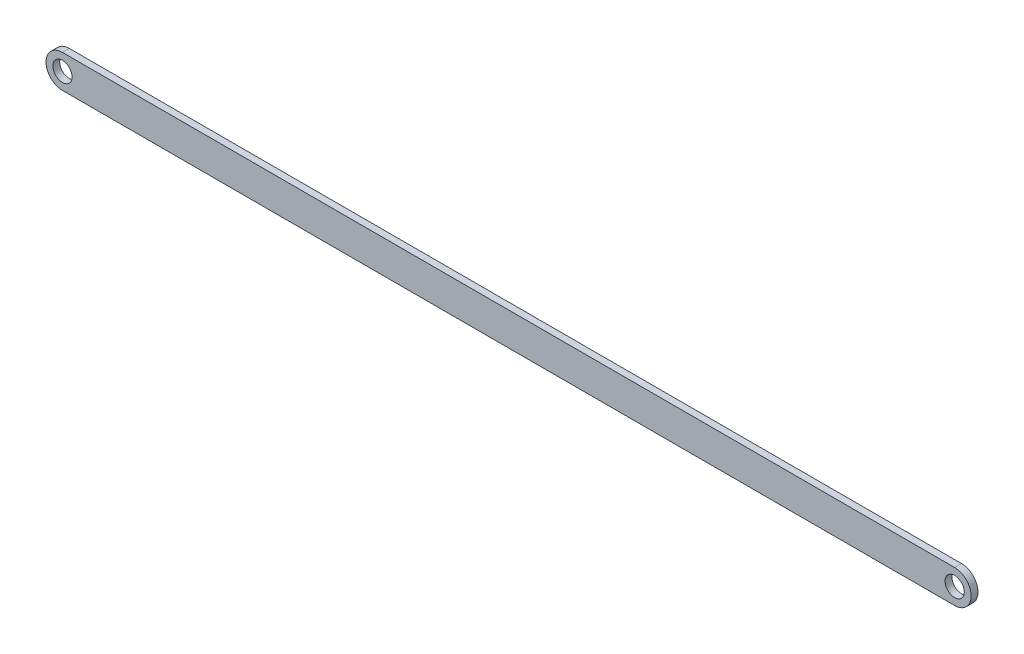
ISO-10303-21;
HEADER;
FILE_DESCRIPTION(('STEP AP214'),'2;1');
FILE_NAME('part.step','',(''),(''),'','','');
FILE_SCHEMA(('AUTOMOTIVE_DESIGN { 1 0 10303 214 1 1 1 1 }'));
ENDSEC;
DATA;
#1=APPLICATION_CONTEXT('core data for automotive mechanical design processes');
#2=APPLICATION_PROTOCOL_DEFINITION('international standard','automotive_design',2000,#1);
#3=PRODUCT_CONTEXT('',#1,'mechanical');
#4=PRODUCT('Part','Part','',(#3));
#5=PRODUCT_RELATED_PRODUCT_CATEGORY('part','',(#4));
#6=PRODUCT_DEFINITION_FORMATION('','',#4);
#7=PRODUCT_DEFINITION_CONTEXT('part definition',#1,'design');
#8=PRODUCT_DEFINITION('design','',#6,#7);
#9=PRODUCT_DEFINITION_SHAPE('','',#8);
#10=(LENGTH_UNIT() NAMED_UNIT(*) SI_UNIT(.MILLI.,.METRE.));
#11=(NAMED_UNIT(*) PLANE_ANGLE_UNIT() SI_UNIT($,.RADIAN.));
#12=(NAMED_UNIT(*) SI_UNIT($,.STERADIAN.) SOLID_ANGLE_UNIT());
#13=UNCERTAINTY_MEASURE_WITH_UNIT(LENGTH_MEASURE(1.E-05),#10,'distance_accuracy_value','');
#14=(GEOMETRIC_REPRESENTATION_CONTEXT(3) GLOBAL_UNCERTAINTY_ASSIGNED_CONTEXT((#13)) GLOBAL_UNIT_ASSIGNED_CONTEXT((#10,
#11,#12)) REPRESENTATION_CONTEXT('',''));
#15=CARTESIAN_POINT('',(0.,0.,0.));
#16=DIRECTION('',(0.,0.,1.));
#17=DIRECTION('',(1.,0.,0.));
#18=AXIS2_PLACEMENT_3D('',#15,#16,#17);
#19=CARTESIAN_POINT('',(0.,12.,5.));
#20=DIRECTION('',(0.,0.,-1.));
#21=DIRECTION('',(-1.,0.,0.));
#22=AXIS2_PLACEMENT_3D('',#19,#20,#21);
#23=CYLINDRICAL_SURFACE('',#22,12.);
#24=CARTESIAN_POINT('',(0.,12.,0.));
#25=DIRECTION('',(0.,0.,1.));
#26=DIRECTION('',(1.,0.,0.));
#27=AXIS2_PLACEMENT_3D('',#24,#25,#26);
#28=CIRCLE('',#27,12.);
#29=CARTESIAN_POINT('',(0.,24.,0.));
#30=VERTEX_POINT('',#29);
#31=CARTESIAN_POINT('',(0.,0.,0.));
#32=VERTEX_POINT('',#31);
#33=EDGE_CURVE('E107',#30,#32,#28,.T.);
#34=ORIENTED_EDGE('',*,*,#33,.T.);
#35=DIRECTION('',(0.,0.,-1.));
#36=VECTOR('',#35,1.);
#37=CARTESIAN_POINT('',(0.,0.,5.));
#38=LINE('',#37,#36);
#39=CARTESIAN_POINT('',(0.,0.,5.));
#40=VERTEX_POINT('',#39);
#41=EDGE_CURVE('E11',#40,#32,#38,.T.);
#42=ORIENTED_EDGE('',*,*,#41,.F.);
#43=CARTESIAN_POINT('',(0.,12.,5.));
#44=DIRECTION('',(0.,0.,1.));
#45=DIRECTION('',(1.,0.,0.));
#46=AXIS2_PLACEMENT_3D('',#43,#44,#45);
#47=CIRCLE('',#46,12.);
#48=CARTESIAN_POINT('',(0.,24.,5.));
#49=VERTEX_POINT('',#48);
#50=EDGE_CURVE('E91',#49,#40,#47,.T.);
#51=ORIENTED_EDGE('',*,*,#50,.F.);
#52=DIRECTION('',(0.,0.,-1.));
#53=VECTOR('',#52,1.);
#54=CARTESIAN_POINT('',(0.,24.,5.));
#55=LINE('',#54,#53);
#56=EDGE_CURVE('E103',#49,#30,#55,.T.);
#57=ORIENTED_EDGE('',*,*,#56,.T.);
#58=EDGE_LOOP('',(#34,#42,#51,#57));
#59=FACE_BOUND('',#58,.T.);
#60=ADVANCED_FACE('F39',(#59),#23,.T.);
#61=CARTESIAN_POINT('',(0.,0.,5.));
#62=DIRECTION('',(0.,1.,0.));
#63=DIRECTION('',(0.,0.,1.));
#64=AXIS2_PLACEMENT_3D('',#61,#62,#63);
#65=PLANE('',#64);
#66=DIRECTION('',(1.,0.,0.));
#67=VECTOR('',#66,1.);
#68=CARTESIAN_POINT('',(0.,0.,0.));
#69=LINE('',#68,#67);
#70=CARTESIAN_POINT('',(650.,0.,0.));
#71=VERTEX_POINT('',#70);
#72=EDGE_CURVE('E96',#32,#71,#69,.T.);
#73=ORIENTED_EDGE('',*,*,#72,.T.);
#74=DIRECTION('',(0.,0.,-1.));
#75=VECTOR('',#74,1.);
#76=CARTESIAN_POINT('',(650.,0.,5.));
#77=LINE('',#76,#75);
#78=CARTESIAN_POINT('',(650.,0.,5.));
#79=VERTEX_POINT('',#78);
#80=EDGE_CURVE('E48',#79,#71,#77,.T.);
#81=ORIENTED_EDGE('',*,*,#80,.F.);
#82=DIRECTION('',(1.,0.,0.));
#83=VECTOR('',#82,1.);
#84=CARTESIAN_POINT('',(0.,0.,5.));
#85=LINE('',#84,#83);
#86=EDGE_CURVE('E86',#40,#79,#85,.T.);
#87=ORIENTED_EDGE('',*,*,#86,.F.);
#88=ORIENTED_EDGE('',*,*,#41,.T.);
#89=EDGE_LOOP('',(#73,#81,#87,#88));
#90=FACE_BOUND('',#89,.T.);
#91=ADVANCED_FACE('F95',(#90),#65,.F.);
#92=CARTESIAN_POINT('',(650.,12.,5.));
#93=DIRECTION('',(0.,0.,-1.));
#94=DIRECTION('',(-1.,0.,0.));
#95=AXIS2_PLACEMENT_3D('',#92,#93,#94);
#96=CYLINDRICAL_SURFACE('',#95,12.);
#97=CARTESIAN_POINT('',(650.,12.,0.));
#98=DIRECTION('',(0.,0.,1.));
#99=DIRECTION('',(1.,0.,0.));
#100=AXIS2_PLACEMENT_3D('',#97,#98,#99);
#101=CIRCLE('',#100,12.);
#102=CARTESIAN_POINT('',(650.,24.,0.));
#103=VERTEX_POINT('',#102);
#104=EDGE_CURVE('E73',#71,#103,#101,.T.);
#105=ORIENTED_EDGE('',*,*,#104,.T.);
#106=DIRECTION('',(0.,0.,-1.));
#107=VECTOR('',#106,1.);
#108=CARTESIAN_POINT('',(650.,24.,5.));
#109=LINE('',#108,#107);
#110=CARTESIAN_POINT('',(650.,24.,5.));
#111=VERTEX_POINT('',#110);
#112=EDGE_CURVE('E98',#111,#103,#109,.T.);
#113=ORIENTED_EDGE('',*,*,#112,.F.);
#114=CARTESIAN_POINT('',(650.,12.,5.));
#115=DIRECTION('',(0.,0.,1.));
#116=DIRECTION('',(1.,0.,0.));
#117=AXIS2_PLACEMENT_3D('',#114,#115,#116);
#118=CIRCLE('',#117,12.);
#119=EDGE_CURVE('E89',#79,#111,#118,.T.);
#120=ORIENTED_EDGE('',*,*,#119,.F.);
#121=ORIENTED_EDGE('',*,*,#80,.T.);
#122=EDGE_LOOP('',(#105,#113,#120,#121));
#123=FACE_BOUND('',#122,.T.);
#124=ADVANCED_FACE('F99',(#123),#96,.T.);
#125=CARTESIAN_POINT('',(0.,24.,5.));
#126=DIRECTION('',(0.,-1.,0.));
#127=DIRECTION('',(0.,0.,-1.));
#128=AXIS2_PLACEMENT_3D('',#125,#126,#127);
#129=PLANE('',#128);
#130=DIRECTION('',(-1.,0.,0.));
#131=VECTOR('',#130,1.);
#132=CARTESIAN_POINT('',(0.,24.,0.));
#133=LINE('',#132,#131);
#134=EDGE_CURVE('E79',#103,#30,#133,.T.);
#135=ORIENTED_EDGE('',*,*,#134,.T.);
#136=ORIENTED_EDGE('',*,*,#56,.F.);
#137=DIRECTION('',(-1.,0.,0.));
#138=VECTOR('',#137,1.);
#139=CARTESIAN_POINT('',(0.,24.,5.));
#140=LINE('',#139,#138);
#141=EDGE_CURVE('E56',#111,#49,#140,.T.);
#142=ORIENTED_EDGE('',*,*,#141,.F.);
#143=ORIENTED_EDGE('',*,*,#112,.T.);
#144=EDGE_LOOP('',(#135,#136,#142,#143));
#145=FACE_BOUND('',#144,.T.);
#146=ADVANCED_FACE('F121',(#145),#129,.F.);
#147=CARTESIAN_POINT('',(0.,12.,5.));
#148=DIRECTION('',(0.,0.,1.));
#149=DIRECTION('',(1.,0.,0.));
#150=AXIS2_PLACEMENT_3D('',#147,#148,#149);
#151=PLANE('',#150);
#152=CARTESIAN_POINT('',(0.,12.,5.));
#153=DIRECTION('',(0.,0.,1.));
#154=DIRECTION('',(1.,0.,0.));
#155=AXIS2_PLACEMENT_3D('',#152,#153,#154);
#156=CIRCLE('',#155,7.);
#157=CARTESIAN_POINT('',(7.,12.,5.));
#158=VERTEX_POINT('',#157);
#159=EDGE_CURVE('E136',#158,#158,#156,.T.);
#160=ORIENTED_EDGE('',*,*,#159,.F.);
#161=EDGE_LOOP('',(#160));
#162=FACE_BOUND('',#161,.T.);
#163=CARTESIAN_POINT('',(650.,12.,5.));
#164=DIRECTION('',(0.,0.,1.));
#165=DIRECTION('',(1.,0.,0.));
#166=AXIS2_PLACEMENT_3D('',#163,#164,#165);
#167=CIRCLE('',#166,7.00000000000004);
#168=CARTESIAN_POINT('',(657.,12.,5.));
#169=VERTEX_POINT('',#168);
#170=EDGE_CURVE('E128',#169,#169,#167,.T.);
#171=ORIENTED_EDGE('',*,*,#170,.F.);
#172=EDGE_LOOP('',(#171));
#173=FACE_BOUND('',#172,.T.);
#174=ORIENTED_EDGE('',*,*,#50,.T.);
#175=ORIENTED_EDGE('',*,*,#86,.T.);
#176=ORIENTED_EDGE('',*,*,#119,.T.);
#177=ORIENTED_EDGE('',*,*,#141,.T.);
#178=EDGE_LOOP('',(#174,#175,#176,#177));
#179=FACE_BOUND('',#178,.T.);
#180=ADVANCED_FACE('F87',(#162,#173,#179),#151,.T.);
#181=CARTESIAN_POINT('',(0.,12.,0.));
#182=DIRECTION('',(0.,0.,1.));
#183=DIRECTION('',(1.,0.,0.));
#184=AXIS2_PLACEMENT_3D('',#181,#182,#183);
#185=PLANE('',#184);
#186=CARTESIAN_POINT('',(0.,12.,0.));
#187=DIRECTION('',(0.,0.,1.));
#188=DIRECTION('',(1.,0.,0.));
#189=AXIS2_PLACEMENT_3D('',#186,#187,#188);
#190=CIRCLE('',#189,7.);
#191=CARTESIAN_POINT('',(7.,12.,0.));
#192=VERTEX_POINT('',#191);
#193=EDGE_CURVE('E111',#192,#192,#190,.T.);
#194=ORIENTED_EDGE('',*,*,#193,.T.);
#195=EDGE_LOOP('',(#194));
#196=FACE_BOUND('',#195,.T.);
#197=CARTESIAN_POINT('',(650.,12.,0.));
#198=DIRECTION('',(0.,0.,1.));
#199=DIRECTION('',(1.,0.,0.));
#200=AXIS2_PLACEMENT_3D('',#197,#198,#199);
#201=CIRCLE('',#200,7.00000000000004);
#202=CARTESIAN_POINT('',(657.,12.,0.));
#203=VERTEX_POINT('',#202);
#204=EDGE_CURVE('E132',#203,#203,#201,.T.);
#205=ORIENTED_EDGE('',*,*,#204,.T.);
#206=EDGE_LOOP('',(#205));
#207=FACE_BOUND('',#206,.T.);
#208=ORIENTED_EDGE('',*,*,#33,.F.);
#209=ORIENTED_EDGE('',*,*,#134,.F.);
#210=ORIENTED_EDGE('',*,*,#104,.F.);
#211=ORIENTED_EDGE('',*,*,#72,.F.);
#212=EDGE_LOOP('',(#208,#209,#210,#211));
#213=FACE_BOUND('',#212,.T.);
#214=ADVANCED_FACE('F124',(#196,#207,#213),#185,.F.);
#215=CARTESIAN_POINT('',(650.,12.,0.));
#216=DIRECTION('',(0.,0.,1.));
#217=DIRECTION('',(1.,0.,0.));
#218=AXIS2_PLACEMENT_3D('',#215,#216,#217);
#219=CYLINDRICAL_SURFACE('',#218,7.00000000000004);
#220=ORIENTED_EDGE('',*,*,#204,.F.);
#221=EDGE_LOOP('',(#220));
#222=FACE_BOUND('',#221,.T.);
#223=ORIENTED_EDGE('',*,*,#170,.T.);
#224=EDGE_LOOP('',(#223));
#225=FACE_BOUND('',#224,.T.);
#226=ADVANCED_FACE('F149',(#222,#225),#219,.F.);
#227=CARTESIAN_POINT('',(0.,12.,0.));
#228=DIRECTION('',(0.,0.,1.));
#229=DIRECTION('',(1.,0.,0.));
#230=AXIS2_PLACEMENT_3D('',#227,#228,#229);
#231=CYLINDRICAL_SURFACE('',#230,7.);
#232=ORIENTED_EDGE('',*,*,#193,.F.);
#233=EDGE_LOOP('',(#232));
#234=FACE_BOUND('',#233,.T.);
#235=ORIENTED_EDGE('',*,*,#159,.T.);
#236=EDGE_LOOP('',(#235));
#237=FACE_BOUND('',#236,.T.);
#238=ADVANCED_FACE('F146',(#234,#237),#231,.F.);
#239=CLOSED_SHELL('',(#60,#91,#124,#146,#180,#214,#226,#238));
#240=MANIFOLD_SOLID_BREP('B2',#239);
#241=ADVANCED_BREP_SHAPE_REPRESENTATION('',(#18,#240),#14);
#242=SHAPE_DEFINITION_REPRESENTATION(#9,#241);
ENDSEC;
END-ISO-10303-21;
